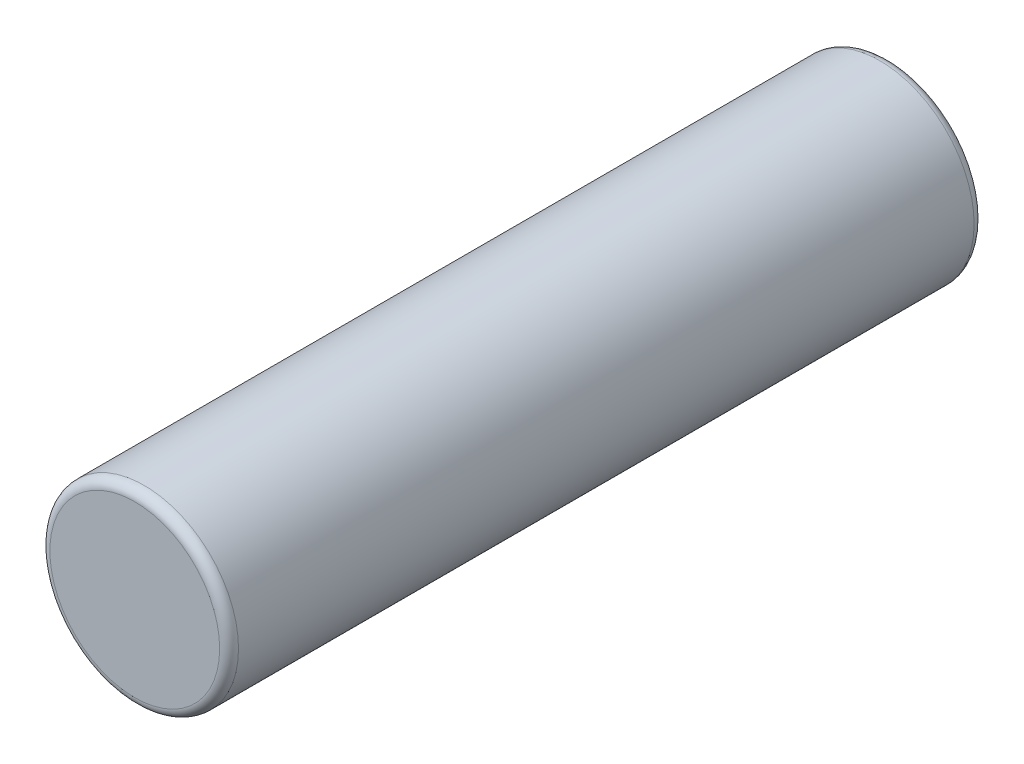
ISO-10303-21;
HEADER;
FILE_DESCRIPTION(('STEP AP214'),'2;1');
FILE_NAME('part.step','',(''),(''),'','','');
FILE_SCHEMA(('AUTOMOTIVE_DESIGN { 1 0 10303 214 1 1 1 1 }'));
ENDSEC;
DATA;
#1=APPLICATION_CONTEXT('core data for automotive mechanical design processes');
#2=APPLICATION_PROTOCOL_DEFINITION('international standard','automotive_design',2000,#1);
#3=PRODUCT_CONTEXT('',#1,'mechanical');
#4=PRODUCT('Part','Part','',(#3));
#5=PRODUCT_RELATED_PRODUCT_CATEGORY('part','',(#4));
#6=PRODUCT_DEFINITION_FORMATION('','',#4);
#7=PRODUCT_DEFINITION_CONTEXT('part definition',#1,'design');
#8=PRODUCT_DEFINITION('design','',#6,#7);
#9=PRODUCT_DEFINITION_SHAPE('','',#8);
#10=(LENGTH_UNIT() NAMED_UNIT(*) SI_UNIT(.MILLI.,.METRE.));
#11=(NAMED_UNIT(*) PLANE_ANGLE_UNIT() SI_UNIT($,.RADIAN.));
#12=(NAMED_UNIT(*) SI_UNIT($,.STERADIAN.) SOLID_ANGLE_UNIT());
#13=UNCERTAINTY_MEASURE_WITH_UNIT(LENGTH_MEASURE(1.E-05),#10,'distance_accuracy_value','');
#14=(GEOMETRIC_REPRESENTATION_CONTEXT(3) GLOBAL_UNCERTAINTY_ASSIGNED_CONTEXT((#13)) GLOBAL_UNIT_ASSIGNED_CONTEXT((#10,
#11,#12)) REPRESENTATION_CONTEXT('',''));
#15=CARTESIAN_POINT('',(0.,0.,0.));
#16=DIRECTION('',(0.,0.,1.));
#17=DIRECTION('',(1.,0.,0.));
#18=AXIS2_PLACEMENT_3D('',#15,#16,#17);
#19=CARTESIAN_POINT('',(0.,0.,10.16));
#20=DIRECTION('',(0.,0.,-1.));
#21=DIRECTION('',(-1.,0.,0.));
#22=AXIS2_PLACEMENT_3D('',#19,#20,#21);
#23=CYLINDRICAL_SURFACE('',#22,1.27);
#24=CARTESIAN_POINT('',(0.,0.,0.127));
#25=DIRECTION('',(0.,0.,1.));
#26=DIRECTION('',(1.,0.,0.));
#27=AXIS2_PLACEMENT_3D('',#24,#25,#26);
#28=CIRCLE('',#27,1.27);
#29=CARTESIAN_POINT('',(1.27,0.,0.127));
#30=VERTEX_POINT('',#29);
#31=EDGE_CURVE('E45',#30,#30,#28,.T.);
#32=ORIENTED_EDGE('',*,*,#31,.T.);
#33=EDGE_LOOP('',(#32));
#34=FACE_BOUND('',#33,.T.);
#35=CARTESIAN_POINT('',(0.,0.,10.033));
#36=DIRECTION('',(0.,0.,1.));
#37=DIRECTION('',(1.,0.,0.));
#38=AXIS2_PLACEMENT_3D('',#35,#36,#37);
#39=CIRCLE('',#38,1.27);
#40=CARTESIAN_POINT('',(1.27,0.,10.033));
#41=VERTEX_POINT('',#40);
#42=EDGE_CURVE('E50',#41,#41,#39,.F.);
#43=ORIENTED_EDGE('',*,*,#42,.T.);
#44=EDGE_LOOP('',(#43));
#45=FACE_BOUND('',#44,.T.);
#46=ADVANCED_FACE('F37',(#34,#45),#23,.T.);
#47=CARTESIAN_POINT('',(0.,0.,10.16));
#48=DIRECTION('',(0.,0.,1.));
#49=DIRECTION('',(1.,0.,0.));
#50=AXIS2_PLACEMENT_3D('',#47,#48,#49);
#51=PLANE('',#50);
#52=CARTESIAN_POINT('',(0.,0.,10.16));
#53=DIRECTION('',(0.,0.,1.));
#54=DIRECTION('',(1.,0.,0.));
#55=AXIS2_PLACEMENT_3D('',#52,#53,#54);
#56=CIRCLE('',#55,1.143);
#57=CARTESIAN_POINT('',(1.143,0.,10.16));
#58=VERTEX_POINT('',#57);
#59=EDGE_CURVE('E55',#58,#58,#56,.T.);
#60=ORIENTED_EDGE('',*,*,#59,.T.);
#61=EDGE_LOOP('',(#60));
#62=FACE_BOUND('',#61,.T.);
#63=ADVANCED_FACE('F62',(#62),#51,.T.);
#64=CARTESIAN_POINT('',(0.,0.,0.));
#65=DIRECTION('',(0.,0.,1.));
#66=DIRECTION('',(1.,0.,0.));
#67=AXIS2_PLACEMENT_3D('',#64,#65,#66);
#68=PLANE('',#67);
#69=CARTESIAN_POINT('',(0.,0.,0.));
#70=DIRECTION('',(0.,0.,1.));
#71=DIRECTION('',(1.,0.,0.));
#72=AXIS2_PLACEMENT_3D('',#69,#70,#71);
#73=CIRCLE('',#72,1.143);
#74=CARTESIAN_POINT('',(1.143,0.,0.));
#75=VERTEX_POINT('',#74);
#76=EDGE_CURVE('E10',#75,#75,#73,.F.);
#77=ORIENTED_EDGE('',*,*,#76,.T.);
#78=EDGE_LOOP('',(#77));
#79=FACE_BOUND('',#78,.T.);
#80=ADVANCED_FACE('F66',(#79),#68,.F.);
#81=CARTESIAN_POINT('',(0.,0.,10.033));
#82=DIRECTION('',(0.,0.,1.));
#83=DIRECTION('',(1.,0.,0.));
#84=AXIS2_PLACEMENT_3D('',#81,#82,#83);
#85=TOROIDAL_SURFACE('',#84,1.143,0.127);
#86=ORIENTED_EDGE('',*,*,#42,.F.);
#87=EDGE_LOOP('',(#86));
#88=FACE_BOUND('',#87,.T.);
#89=ORIENTED_EDGE('',*,*,#59,.F.);
#90=EDGE_LOOP('',(#89));
#91=FACE_BOUND('',#90,.T.);
#92=ADVANCED_FACE('F64',(#88,#91),#85,.T.);
#93=CARTESIAN_POINT('',(0.,0.,0.127));
#94=DIRECTION('',(0.,0.,1.));
#95=DIRECTION('',(1.,0.,0.));
#96=AXIS2_PLACEMENT_3D('',#93,#94,#95);
#97=TOROIDAL_SURFACE('',#96,1.143,0.127);
#98=ORIENTED_EDGE('',*,*,#76,.F.);
#99=EDGE_LOOP('',(#98));
#100=FACE_BOUND('',#99,.T.);
#101=ORIENTED_EDGE('',*,*,#31,.F.);
#102=EDGE_LOOP('',(#101));
#103=FACE_BOUND('',#102,.T.);
#104=ADVANCED_FACE('F39',(#100,#103),#97,.T.);
#105=CLOSED_SHELL('',(#46,#63,#80,#92,#104));
#106=MANIFOLD_SOLID_BREP('B2',#105);
#107=ADVANCED_BREP_SHAPE_REPRESENTATION('',(#18,#106),#14);
#108=SHAPE_DEFINITION_REPRESENTATION(#9,#107);
ENDSEC;
END-ISO-10303-21;
